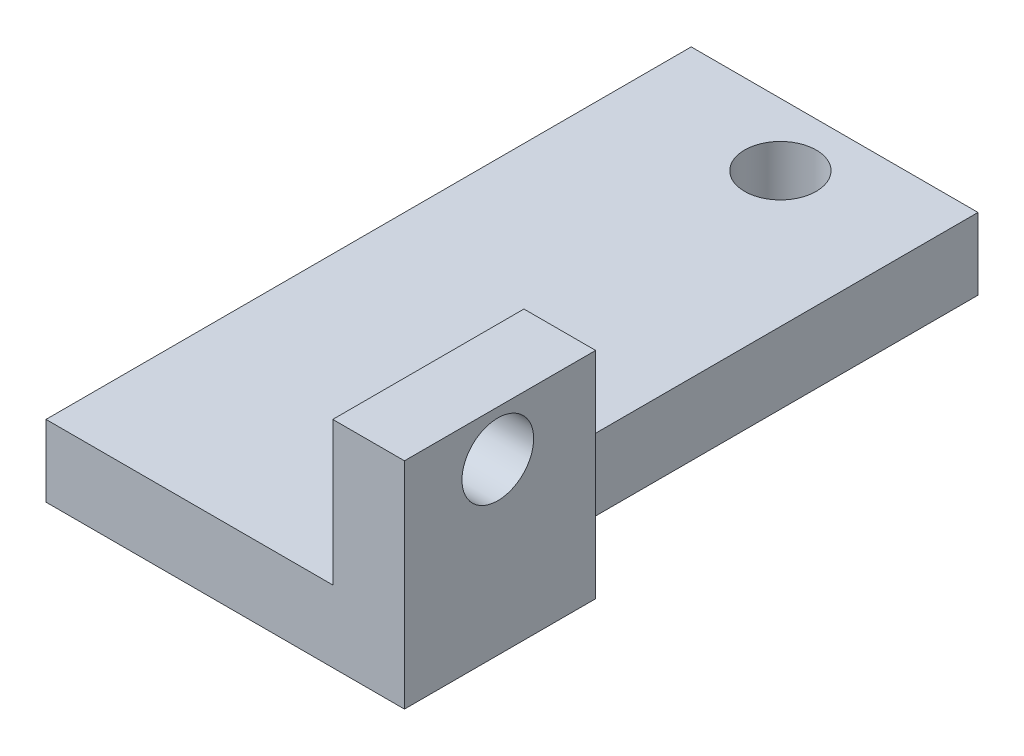
ISO-10303-21;
HEADER;
FILE_DESCRIPTION(('STEP AP214'),'2;1');
FILE_NAME('part.step','',(''),(''),'','','');
FILE_SCHEMA(('AUTOMOTIVE_DESIGN { 1 0 10303 214 1 1 1 1 }'));
ENDSEC;
DATA;
#1=APPLICATION_CONTEXT('core data for automotive mechanical design processes');
#2=APPLICATION_PROTOCOL_DEFINITION('international standard','automotive_design',2000,#1);
#3=PRODUCT_CONTEXT('',#1,'mechanical');
#4=PRODUCT('Part','Part','',(#3));
#5=PRODUCT_RELATED_PRODUCT_CATEGORY('part','',(#4));
#6=PRODUCT_DEFINITION_FORMATION('','',#4);
#7=PRODUCT_DEFINITION_CONTEXT('part definition',#1,'design');
#8=PRODUCT_DEFINITION('design','',#6,#7);
#9=PRODUCT_DEFINITION_SHAPE('','',#8);
#10=(LENGTH_UNIT() NAMED_UNIT(*) SI_UNIT(.MILLI.,.METRE.));
#11=(NAMED_UNIT(*) PLANE_ANGLE_UNIT() SI_UNIT($,.RADIAN.));
#12=(NAMED_UNIT(*) SI_UNIT($,.STERADIAN.) SOLID_ANGLE_UNIT());
#13=UNCERTAINTY_MEASURE_WITH_UNIT(LENGTH_MEASURE(1.E-05),#10,'distance_accuracy_value','');
#14=(GEOMETRIC_REPRESENTATION_CONTEXT(3) GLOBAL_UNCERTAINTY_ASSIGNED_CONTEXT((#13)) GLOBAL_UNIT_ASSIGNED_CONTEXT((#10,
#11,#12)) REPRESENTATION_CONTEXT('',''));
#15=CARTESIAN_POINT('',(0.,0.,0.));
#16=DIRECTION('',(0.,0.,1.));
#17=DIRECTION('',(1.,0.,0.));
#18=AXIS2_PLACEMENT_3D('',#15,#16,#17);
#19=CARTESIAN_POINT('',(40.3874355826192,9.2281100825875,70.1100842742963));
#20=DIRECTION('',(-1.,0.,0.));
#21=DIRECTION('',(0.,0.,1.));
#22=AXIS2_PLACEMENT_3D('',#19,#20,#21);
#23=PLANE('',#22);
#24=DIRECTION('',(0.,1.,0.));
#25=VECTOR('',#24,1.);
#26=CARTESIAN_POINT('',(40.3874355826192,-11.7718899174125,14.1100842742963));
#27=LINE('',#26,#25);
#28=CARTESIAN_POINT('',(40.3874355826192,-11.7718899174125,14.1100842742963));
#29=VERTEX_POINT('',#28);
#30=CARTESIAN_POINT('',(40.3874355826192,9.2281100825875,14.1100842742963));
#31=VERTEX_POINT('',#30);
#32=EDGE_CURVE('E54',#29,#31,#27,.T.);
#33=ORIENTED_EDGE('',*,*,#32,.F.);
#34=DIRECTION('',(0.,0.,-1.));
#35=VECTOR('',#34,1.);
#36=CARTESIAN_POINT('',(40.3874355826192,-11.7718899174125,70.1100842742963));
#37=LINE('',#36,#35);
#38=CARTESIAN_POINT('',(40.3874355826192,-11.7718899174125,-118.889915725704));
#39=VERTEX_POINT('',#38);
#40=EDGE_CURVE('E120',#29,#39,#37,.T.);
#41=ORIENTED_EDGE('',*,*,#40,.T.);
#42=DIRECTION('',(0.,-1.,0.));
#43=VECTOR('',#42,1.);
#44=CARTESIAN_POINT('',(40.3874355826192,9.2281100825875,-118.889915725704));
#45=LINE('',#44,#43);
#46=CARTESIAN_POINT('',(40.3874355826192,9.2281100825875,-118.889915725704));
#47=VERTEX_POINT('',#46);
#48=EDGE_CURVE('E47',#47,#39,#45,.T.);
#49=ORIENTED_EDGE('',*,*,#48,.F.);
#50=DIRECTION('',(0.,0.,-1.));
#51=VECTOR('',#50,1.);
#52=CARTESIAN_POINT('',(40.3874355826192,9.2281100825875,70.1100842742963));
#53=LINE('',#52,#51);
#54=EDGE_CURVE('E181',#31,#47,#53,.T.);
#55=ORIENTED_EDGE('',*,*,#54,.F.);
#56=EDGE_LOOP('',(#33,#41,#49,#55));
#57=FACE_BOUND('',#56,.T.);
#58=ADVANCED_FACE('F38',(#57),#23,.F.);
#59=CARTESIAN_POINT('',(-43.6125644173808,9.2281100825875,70.1100842742963));
#60=DIRECTION('',(0.,-1.,0.));
#61=DIRECTION('',(0.,0.,-1.));
#62=AXIS2_PLACEMENT_3D('',#59,#60,#61);
#63=PLANE('',#62);
#64=DIRECTION('',(0.,0.,1.));
#65=VECTOR('',#64,1.);
#66=CARTESIAN_POINT('',(-43.6125644173808,9.2281100825875,70.1100842742963));
#67=LINE('',#66,#65);
#68=CARTESIAN_POINT('',(-43.6125644173808,9.2281100825875,-118.889915725704));
#69=VERTEX_POINT('',#68);
#70=CARTESIAN_POINT('',(-43.6125644173808,9.2281100825875,70.1100842742963));
#71=VERTEX_POINT('',#70);
#72=EDGE_CURVE('E176',#69,#71,#67,.T.);
#73=ORIENTED_EDGE('',*,*,#72,.T.);
#74=DIRECTION('',(1.,0.,0.));
#75=VECTOR('',#74,1.);
#76=CARTESIAN_POINT('',(-43.6125644173808,9.2281100825875,70.1100842742963));
#77=LINE('',#76,#75);
#78=CARTESIAN_POINT('',(40.3874355826192,9.2281100825875,70.1100842742963));
#79=VERTEX_POINT('',#78);
#80=EDGE_CURVE('E87',#71,#79,#77,.T.);
#81=ORIENTED_EDGE('',*,*,#80,.T.);
#82=EDGE_CURVE('E182',#79,#31,#53,.T.);
#83=ORIENTED_EDGE('',*,*,#82,.T.);
#84=ORIENTED_EDGE('',*,*,#54,.T.);
#85=DIRECTION('',(-1.,0.,0.));
#86=VECTOR('',#85,1.);
#87=CARTESIAN_POINT('',(-43.6125644173808,9.2281100825875,-118.889915725704));
#88=LINE('',#87,#86);
#89=EDGE_CURVE('E63',#47,#69,#88,.T.);
#90=ORIENTED_EDGE('',*,*,#89,.T.);
#91=EDGE_LOOP('',(#73,#81,#83,#84,#90));
#92=FACE_BOUND('',#91,.T.);
#93=CARTESIAN_POINT('',(0.856301288556519,9.2281100825875,-100.536642578253));
#94=DIRECTION('',(0.,1.,0.));
#95=DIRECTION('',(0.,0.,1.));
#96=AXIS2_PLACEMENT_3D('',#93,#94,#95);
#97=CIRCLE('',#96,10.5);
#98=CARTESIAN_POINT('',(0.856301288556519,9.2281100825875,-90.0366425782526));
#99=VERTEX_POINT('',#98);
#100=EDGE_CURVE('E169',#99,#99,#97,.T.);
#101=ORIENTED_EDGE('',*,*,#100,.F.);
#102=EDGE_LOOP('',(#101));
#103=FACE_BOUND('',#102,.T.);
#104=ADVANCED_FACE('F200',(#92,#103),#63,.F.);
#105=CARTESIAN_POINT('',(-43.6125644173808,-11.7718899174125,70.1100842742963));
#106=DIRECTION('',(0.,-1.,0.));
#107=DIRECTION('',(0.,0.,-1.));
#108=AXIS2_PLACEMENT_3D('',#105,#106,#107);
#109=PLANE('',#108);
#110=DIRECTION('',(0.,0.,1.));
#111=VECTOR('',#110,1.);
#112=CARTESIAN_POINT('',(-43.6125644173808,-11.7718899174125,70.1100842742963));
#113=LINE('',#112,#111);
#114=CARTESIAN_POINT('',(-43.6125644173808,-11.7718899174125,-118.889915725704));
#115=VERTEX_POINT('',#114);
#116=CARTESIAN_POINT('',(-43.6125644173808,-11.7718899174125,70.1100842742963));
#117=VERTEX_POINT('',#116);
#118=EDGE_CURVE('E121',#115,#117,#113,.T.);
#119=ORIENTED_EDGE('',*,*,#118,.F.);
#120=DIRECTION('',(-1.,0.,0.));
#121=VECTOR('',#120,1.);
#122=CARTESIAN_POINT('',(-43.6125644173808,-11.7718899174125,-118.889915725704));
#123=LINE('',#122,#121);
#124=EDGE_CURVE('E80',#39,#115,#123,.T.);
#125=ORIENTED_EDGE('',*,*,#124,.F.);
#126=ORIENTED_EDGE('',*,*,#40,.F.);
#127=DIRECTION('',(-1.,0.,0.));
#128=VECTOR('',#127,1.);
#129=CARTESIAN_POINT('',(61.3874355826192,-11.7718899174125,14.1100842742963));
#130=LINE('',#129,#128);
#131=CARTESIAN_POINT('',(61.3874355826192,-11.7718899174125,14.1100842742963));
#132=VERTEX_POINT('',#131);
#133=EDGE_CURVE('E128',#132,#29,#130,.T.);
#134=ORIENTED_EDGE('',*,*,#133,.F.);
#135=DIRECTION('',(0.,0.,-1.));
#136=VECTOR('',#135,1.);
#137=CARTESIAN_POINT('',(61.3874355826192,-11.7718899174125,70.1100842742963));
#138=LINE('',#137,#136);
#139=CARTESIAN_POINT('',(61.3874355826192,-11.7718899174125,70.1100842742963));
#140=VERTEX_POINT('',#139);
#141=EDGE_CURVE('E124',#140,#132,#138,.T.);
#142=ORIENTED_EDGE('',*,*,#141,.F.);
#143=DIRECTION('',(1.,0.,0.));
#144=VECTOR('',#143,1.);
#145=CARTESIAN_POINT('',(-43.6125644173808,-11.7718899174125,70.1100842742963));
#146=LINE('',#145,#144);
#147=EDGE_CURVE('E109',#117,#140,#146,.T.);
#148=ORIENTED_EDGE('',*,*,#147,.F.);
#149=EDGE_LOOP('',(#119,#125,#126,#134,#142,#148));
#150=FACE_BOUND('',#149,.T.);
#151=CARTESIAN_POINT('',(0.856301288556519,-11.7718899174125,-100.536642578253));
#152=DIRECTION('',(0.,1.,0.));
#153=DIRECTION('',(0.,0.,1.));
#154=AXIS2_PLACEMENT_3D('',#151,#152,#153);
#155=CIRCLE('',#154,10.5);
#156=CARTESIAN_POINT('',(0.856301288556519,-11.7718899174125,-90.0366425782526));
#157=VERTEX_POINT('',#156);
#158=EDGE_CURVE('E168',#157,#157,#155,.T.);
#159=ORIENTED_EDGE('',*,*,#158,.T.);
#160=EDGE_LOOP('',(#159));
#161=FACE_BOUND('',#160,.T.);
#162=ADVANCED_FACE('F125',(#150,#161),#109,.T.);
#163=CARTESIAN_POINT('',(-43.6125644173808,9.2281100825875,70.1100842742963));
#164=DIRECTION('',(1.,0.,0.));
#165=DIRECTION('',(0.,0.,-1.));
#166=AXIS2_PLACEMENT_3D('',#163,#164,#165);
#167=PLANE('',#166);
#168=ORIENTED_EDGE('',*,*,#118,.T.);
#169=DIRECTION('',(0.,-1.,0.));
#170=VECTOR('',#169,1.);
#171=CARTESIAN_POINT('',(-43.6125644173808,9.2281100825875,70.1100842742963));
#172=LINE('',#171,#170);
#173=EDGE_CURVE('E11',#71,#117,#172,.T.);
#174=ORIENTED_EDGE('',*,*,#173,.F.);
#175=ORIENTED_EDGE('',*,*,#72,.F.);
#176=DIRECTION('',(0.,-1.,0.));
#177=VECTOR('',#176,1.);
#178=CARTESIAN_POINT('',(-43.6125644173808,9.2281100825875,-118.889915725704));
#179=LINE('',#178,#177);
#180=EDGE_CURVE('E187',#69,#115,#179,.T.);
#181=ORIENTED_EDGE('',*,*,#180,.T.);
#182=EDGE_LOOP('',(#168,#174,#175,#181));
#183=FACE_BOUND('',#182,.T.);
#184=ADVANCED_FACE('F40',(#183),#167,.F.);
#185=CARTESIAN_POINT('',(-43.6125644173808,9.2281100825875,70.1100842742963));
#186=DIRECTION('',(0.,0.,-1.));
#187=DIRECTION('',(-1.,0.,0.));
#188=AXIS2_PLACEMENT_3D('',#185,#186,#187);
#189=PLANE('',#188);
#190=ORIENTED_EDGE('',*,*,#147,.T.);
#191=DIRECTION('',(0.,-1.,0.));
#192=VECTOR('',#191,1.);
#193=CARTESIAN_POINT('',(61.3874355826192,-11.7718899174125,70.1100842742963));
#194=LINE('',#193,#192);
#195=CARTESIAN_POINT('',(61.3874355826192,51.2281100825875,70.1100842742963));
#196=VERTEX_POINT('',#195);
#197=EDGE_CURVE('E114',#196,#140,#194,.T.);
#198=ORIENTED_EDGE('',*,*,#197,.F.);
#199=DIRECTION('',(-1.,0.,0.));
#200=VECTOR('',#199,1.);
#201=CARTESIAN_POINT('',(61.3874355826192,51.2281100825875,70.1100842742963));
#202=LINE('',#201,#200);
#203=CARTESIAN_POINT('',(40.3874355826192,51.2281100825875,70.1100842742963));
#204=VERTEX_POINT('',#203);
#205=EDGE_CURVE('E152',#196,#204,#202,.T.);
#206=ORIENTED_EDGE('',*,*,#205,.T.);
#207=DIRECTION('',(0.,-1.,0.));
#208=VECTOR('',#207,1.);
#209=CARTESIAN_POINT('',(40.3874355826192,-11.7718899174125,70.1100842742963));
#210=LINE('',#209,#208);
#211=EDGE_CURVE('E153',#204,#79,#210,.T.);
#212=ORIENTED_EDGE('',*,*,#211,.T.);
#213=ORIENTED_EDGE('',*,*,#80,.F.);
#214=ORIENTED_EDGE('',*,*,#173,.T.);
#215=EDGE_LOOP('',(#190,#198,#206,#212,#213,#214));
#216=FACE_BOUND('',#215,.T.);
#217=ADVANCED_FACE('F111',(#216),#189,.F.);
#218=CARTESIAN_POINT('',(-43.6125644173808,9.2281100825875,-118.889915725704));
#219=DIRECTION('',(0.,0.,1.));
#220=DIRECTION('',(1.,0.,0.));
#221=AXIS2_PLACEMENT_3D('',#218,#219,#220);
#222=PLANE('',#221);
#223=ORIENTED_EDGE('',*,*,#124,.T.);
#224=ORIENTED_EDGE('',*,*,#180,.F.);
#225=ORIENTED_EDGE('',*,*,#89,.F.);
#226=ORIENTED_EDGE('',*,*,#48,.T.);
#227=EDGE_LOOP('',(#223,#224,#225,#226));
#228=FACE_BOUND('',#227,.T.);
#229=ADVANCED_FACE('F197',(#228),#222,.F.);
#230=CARTESIAN_POINT('',(0.856301288556519,9.2281100825875,-100.536642578253));
#231=DIRECTION('',(0.,-1.,0.));
#232=DIRECTION('',(0.,0.,-1.));
#233=AXIS2_PLACEMENT_3D('',#230,#231,#232);
#234=CYLINDRICAL_SURFACE('',#233,10.5);
#235=ORIENTED_EDGE('',*,*,#100,.T.);
#236=EDGE_LOOP('',(#235));
#237=FACE_BOUND('',#236,.T.);
#238=ORIENTED_EDGE('',*,*,#158,.F.);
#239=EDGE_LOOP('',(#238));
#240=FACE_BOUND('',#239,.T.);
#241=ADVANCED_FACE('F243',(#237,#240),#234,.F.);
#242=CARTESIAN_POINT('',(40.3874355826192,-11.7718899174125,70.1100842742963));
#243=DIRECTION('',(-1.,0.,0.));
#244=DIRECTION('',(0.,0.,1.));
#245=AXIS2_PLACEMENT_3D('',#242,#243,#244);
#246=PLANE('',#245);
#247=CARTESIAN_POINT('',(40.3874355826192,37.9303974382733,42.7691901248958));
#248=DIRECTION('',(1.,0.,0.));
#249=DIRECTION('',(0.,0.,-1.));
#250=AXIS2_PLACEMENT_3D('',#247,#248,#249);
#251=CIRCLE('',#250,10.5);
#252=CARTESIAN_POINT('',(40.3874355826192,37.9303974382733,32.2691901248958));
#253=VERTEX_POINT('',#252);
#254=EDGE_CURVE('E145',#253,#253,#251,.T.);
#255=ORIENTED_EDGE('',*,*,#254,.T.);
#256=EDGE_LOOP('',(#255));
#257=FACE_BOUND('',#256,.T.);
#258=ORIENTED_EDGE('',*,*,#82,.F.);
#259=ORIENTED_EDGE('',*,*,#211,.F.);
#260=DIRECTION('',(0.,0.,1.));
#261=VECTOR('',#260,1.);
#262=CARTESIAN_POINT('',(40.3874355826192,51.2281100825875,70.1100842742963));
#263=LINE('',#262,#261);
#264=CARTESIAN_POINT('',(40.3874355826192,51.2281100825875,14.1100842742963));
#265=VERTEX_POINT('',#264);
#266=EDGE_CURVE('E140',#265,#204,#263,.T.);
#267=ORIENTED_EDGE('',*,*,#266,.F.);
#268=EDGE_CURVE('E156',#31,#265,#27,.T.);
#269=ORIENTED_EDGE('',*,*,#268,.F.);
#270=EDGE_LOOP('',(#258,#259,#267,#269));
#271=FACE_BOUND('',#270,.T.);
#272=ADVANCED_FACE('F206',(#257,#271),#246,.T.);
#273=CARTESIAN_POINT('',(61.3874355826192,-11.7718899174125,70.1100842742963));
#274=DIRECTION('',(-1.,0.,0.));
#275=DIRECTION('',(0.,0.,1.));
#276=AXIS2_PLACEMENT_3D('',#273,#274,#275);
#277=PLANE('',#276);
#278=ORIENTED_EDGE('',*,*,#197,.T.);
#279=ORIENTED_EDGE('',*,*,#141,.T.);
#280=DIRECTION('',(0.,1.,0.));
#281=VECTOR('',#280,1.);
#282=CARTESIAN_POINT('',(61.3874355826192,-11.7718899174125,14.1100842742963));
#283=LINE('',#282,#281);
#284=CARTESIAN_POINT('',(61.3874355826192,51.2281100825875,14.1100842742963));
#285=VERTEX_POINT('',#284);
#286=EDGE_CURVE('E132',#132,#285,#283,.T.);
#287=ORIENTED_EDGE('',*,*,#286,.T.);
#288=DIRECTION('',(0.,0.,1.));
#289=VECTOR('',#288,1.);
#290=CARTESIAN_POINT('',(61.3874355826192,51.2281100825875,70.1100842742963));
#291=LINE('',#290,#289);
#292=EDGE_CURVE('E137',#285,#196,#291,.T.);
#293=ORIENTED_EDGE('',*,*,#292,.T.);
#294=EDGE_LOOP('',(#278,#279,#287,#293));
#295=FACE_BOUND('',#294,.T.);
#296=CARTESIAN_POINT('',(61.3874355826192,37.9303974382733,42.7691901248958));
#297=DIRECTION('',(1.,0.,0.));
#298=DIRECTION('',(0.,0.,-1.));
#299=AXIS2_PLACEMENT_3D('',#296,#297,#298);
#300=CIRCLE('',#299,10.5);
#301=CARTESIAN_POINT('',(61.3874355826192,37.9303974382733,32.2691901248958));
#302=VERTEX_POINT('',#301);
#303=EDGE_CURVE('E157',#302,#302,#300,.T.);
#304=ORIENTED_EDGE('',*,*,#303,.F.);
#305=EDGE_LOOP('',(#304));
#306=FACE_BOUND('',#305,.T.);
#307=ADVANCED_FACE('F134',(#295,#306),#277,.F.);
#308=CARTESIAN_POINT('',(61.3874355826192,-11.7718899174125,14.1100842742963));
#309=DIRECTION('',(0.,0.,1.));
#310=DIRECTION('',(1.,0.,0.));
#311=AXIS2_PLACEMENT_3D('',#308,#309,#310);
#312=PLANE('',#311);
#313=ORIENTED_EDGE('',*,*,#32,.T.);
#314=ORIENTED_EDGE('',*,*,#268,.T.);
#315=DIRECTION('',(-1.,0.,0.));
#316=VECTOR('',#315,1.);
#317=CARTESIAN_POINT('',(61.3874355826192,51.2281100825875,14.1100842742963));
#318=LINE('',#317,#316);
#319=EDGE_CURVE('E162',#285,#265,#318,.T.);
#320=ORIENTED_EDGE('',*,*,#319,.F.);
#321=ORIENTED_EDGE('',*,*,#286,.F.);
#322=ORIENTED_EDGE('',*,*,#133,.T.);
#323=EDGE_LOOP('',(#313,#314,#320,#321,#322));
#324=FACE_BOUND('',#323,.T.);
#325=ADVANCED_FACE('F212',(#324),#312,.F.);
#326=CARTESIAN_POINT('',(61.3874355826192,51.2281100825875,70.1100842742963));
#327=DIRECTION('',(0.,-1.,0.));
#328=DIRECTION('',(0.,0.,-1.));
#329=AXIS2_PLACEMENT_3D('',#326,#327,#328);
#330=PLANE('',#329);
#331=ORIENTED_EDGE('',*,*,#266,.T.);
#332=ORIENTED_EDGE('',*,*,#205,.F.);
#333=ORIENTED_EDGE('',*,*,#292,.F.);
#334=ORIENTED_EDGE('',*,*,#319,.T.);
#335=EDGE_LOOP('',(#331,#332,#333,#334));
#336=FACE_BOUND('',#335,.T.);
#337=ADVANCED_FACE('F209',(#336),#330,.F.);
#338=CARTESIAN_POINT('',(61.3874355826192,37.9303974382733,42.7691901248958));
#339=DIRECTION('',(-1.,0.,0.));
#340=DIRECTION('',(0.,0.,1.));
#341=AXIS2_PLACEMENT_3D('',#338,#339,#340);
#342=CYLINDRICAL_SURFACE('',#341,10.5);
#343=ORIENTED_EDGE('',*,*,#303,.T.);
#344=EDGE_LOOP('',(#343));
#345=FACE_BOUND('',#344,.T.);
#346=ORIENTED_EDGE('',*,*,#254,.F.);
#347=EDGE_LOOP('',(#346));
#348=FACE_BOUND('',#347,.T.);
#349=ADVANCED_FACE('F221',(#345,#348),#342,.F.);
#350=CLOSED_SHELL('',(#58,#104,#162,#184,#217,#229,#241,#272,#307,#325,#337,#349));
#351=MANIFOLD_SOLID_BREP('B2',#350);
#352=ADVANCED_BREP_SHAPE_REPRESENTATION('',(#18,#351),#14);
#353=SHAPE_DEFINITION_REPRESENTATION(#9,#352);
ENDSEC;
END-ISO-10303-21;
